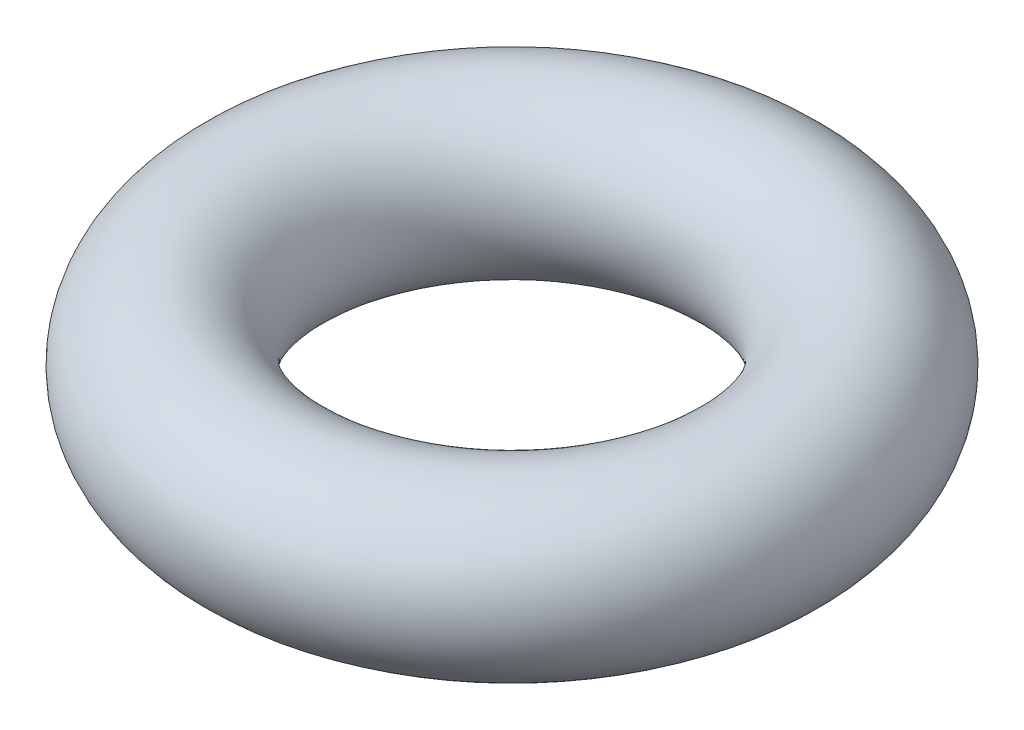
ISO-10303-21;
HEADER;
FILE_DESCRIPTION(('STEP AP214'),'2;1');
FILE_NAME('part.step','',(''),(''),'','','');
FILE_SCHEMA(('AUTOMOTIVE_DESIGN { 1 0 10303 214 1 1 1 1 }'));
ENDSEC;
DATA;
#1=APPLICATION_CONTEXT('core data for automotive mechanical design processes');
#2=APPLICATION_PROTOCOL_DEFINITION('international standard','automotive_design',2000,#1);
#3=PRODUCT_CONTEXT('',#1,'mechanical');
#4=PRODUCT('Part','Part','',(#3));
#5=PRODUCT_RELATED_PRODUCT_CATEGORY('part','',(#4));
#6=PRODUCT_DEFINITION_FORMATION('','',#4);
#7=PRODUCT_DEFINITION_CONTEXT('part definition',#1,'design');
#8=PRODUCT_DEFINITION('design','',#6,#7);
#9=PRODUCT_DEFINITION_SHAPE('','',#8);
#10=(LENGTH_UNIT() NAMED_UNIT(*) SI_UNIT(.MILLI.,.METRE.));
#11=(NAMED_UNIT(*) PLANE_ANGLE_UNIT() SI_UNIT($,.RADIAN.));
#12=(NAMED_UNIT(*) SI_UNIT($,.STERADIAN.) SOLID_ANGLE_UNIT());
#13=UNCERTAINTY_MEASURE_WITH_UNIT(LENGTH_MEASURE(1.E-05),#10,'distance_accuracy_value','');
#14=(GEOMETRIC_REPRESENTATION_CONTEXT(3) GLOBAL_UNCERTAINTY_ASSIGNED_CONTEXT((#13)) GLOBAL_UNIT_ASSIGNED_CONTEXT((#10,
#11,#12)) REPRESENTATION_CONTEXT('',''));
#15=CARTESIAN_POINT('',(0.,0.,0.));
#16=DIRECTION('',(0.,0.,1.));
#17=DIRECTION('',(1.,0.,0.));
#18=AXIS2_PLACEMENT_3D('',#15,#16,#17);
#19=CARTESIAN_POINT('',(0.,0.,0.));
#20=DIRECTION('',(0.,1.,0.));
#21=DIRECTION('',(0.,0.,1.));
#22=AXIS2_PLACEMENT_3D('',#19,#20,#21);
#23=TOROIDAL_SURFACE('',#22,76.2,25.4);
#24=CARTESIAN_POINT('',(0.,0.,101.6));
#25=VERTEX_POINT('',#24);
#26=VERTEX_LOOP('',#25);
#27=FACE_BOUND('',#26,.T.);
#28=ADVANCED_FACE('F27',(#27),#23,.T.);
#29=CLOSED_SHELL('',(#28));
#30=MANIFOLD_SOLID_BREP('B2',#29);
#31=ADVANCED_BREP_SHAPE_REPRESENTATION('',(#18,#30),#14);
#32=SHAPE_DEFINITION_REPRESENTATION(#9,#31);
ENDSEC;
END-ISO-10303-21;
